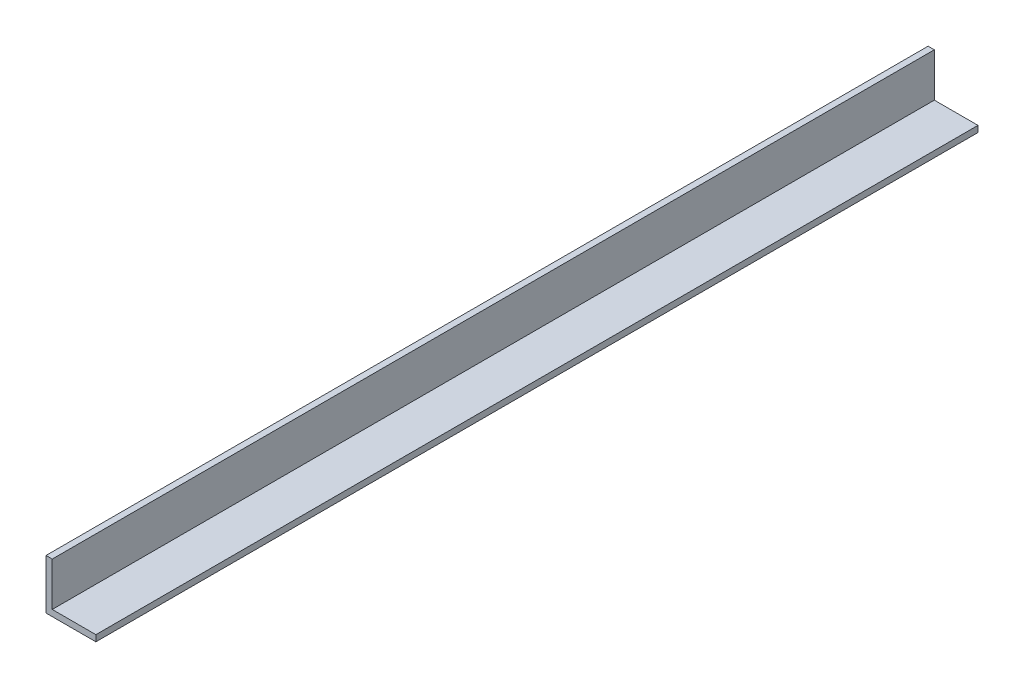
ISO-10303-21;
HEADER;
FILE_DESCRIPTION(('STEP AP214'),'2;1');
FILE_NAME('part.step','',(''),(''),'','','');
FILE_SCHEMA(('AUTOMOTIVE_DESIGN { 1 0 10303 214 1 1 1 1 }'));
ENDSEC;
DATA;
#1=APPLICATION_CONTEXT('core data for automotive mechanical design processes');
#2=APPLICATION_PROTOCOL_DEFINITION('international standard','automotive_design',2000,#1);
#3=PRODUCT_CONTEXT('',#1,'mechanical');
#4=PRODUCT('Part','Part','',(#3));
#5=PRODUCT_RELATED_PRODUCT_CATEGORY('part','',(#4));
#6=PRODUCT_DEFINITION_FORMATION('','',#4);
#7=PRODUCT_DEFINITION_CONTEXT('part definition',#1,'design');
#8=PRODUCT_DEFINITION('design','',#6,#7);
#9=PRODUCT_DEFINITION_SHAPE('','',#8);
#10=(LENGTH_UNIT() NAMED_UNIT(*) SI_UNIT(.MILLI.,.METRE.));
#11=(NAMED_UNIT(*) PLANE_ANGLE_UNIT() SI_UNIT($,.RADIAN.));
#12=(NAMED_UNIT(*) SI_UNIT($,.STERADIAN.) SOLID_ANGLE_UNIT());
#13=UNCERTAINTY_MEASURE_WITH_UNIT(LENGTH_MEASURE(1.E-05),#10,'distance_accuracy_value','');
#14=(GEOMETRIC_REPRESENTATION_CONTEXT(3) GLOBAL_UNCERTAINTY_ASSIGNED_CONTEXT((#13)) GLOBAL_UNIT_ASSIGNED_CONTEXT((#10,
#11,#12)) REPRESENTATION_CONTEXT('',''));
#15=CARTESIAN_POINT('',(0.,0.,0.));
#16=DIRECTION('',(0.,0.,1.));
#17=DIRECTION('',(1.,0.,0.));
#18=AXIS2_PLACEMENT_3D('',#15,#16,#17);
#19=CARTESIAN_POINT('',(3.175,25.4,224.6));
#20=DIRECTION('',(0.,-1.,0.));
#21=DIRECTION('',(0.,0.,-1.));
#22=AXIS2_PLACEMENT_3D('',#19,#20,#21);
#23=PLANE('',#22);
#24=DIRECTION('',(-1.,0.,0.));
#25=VECTOR('',#24,1.);
#26=CARTESIAN_POINT('',(3.175,25.4,-224.6));
#27=LINE('',#26,#25);
#28=CARTESIAN_POINT('',(3.175,25.4,-224.6));
#29=VERTEX_POINT('',#28);
#30=CARTESIAN_POINT('',(0.,25.4,-224.6));
#31=VERTEX_POINT('',#30);
#32=EDGE_CURVE('E127',#29,#31,#27,.T.);
#33=ORIENTED_EDGE('',*,*,#32,.T.);
#34=DIRECTION('',(0.,0.,-1.));
#35=VECTOR('',#34,1.);
#36=CARTESIAN_POINT('',(0.,25.4,224.6));
#37=LINE('',#36,#35);
#38=CARTESIAN_POINT('',(0.,25.4,224.6));
#39=VERTEX_POINT('',#38);
#40=EDGE_CURVE('E11',#39,#31,#37,.T.);
#41=ORIENTED_EDGE('',*,*,#40,.F.);
#42=DIRECTION('',(-1.,0.,0.));
#43=VECTOR('',#42,1.);
#44=CARTESIAN_POINT('',(3.175,25.4,224.6));
#45=LINE('',#44,#43);
#46=CARTESIAN_POINT('',(3.175,25.4,224.6));
#47=VERTEX_POINT('',#46);
#48=EDGE_CURVE('E137',#47,#39,#45,.T.);
#49=ORIENTED_EDGE('',*,*,#48,.F.);
#50=DIRECTION('',(0.,0.,-1.));
#51=VECTOR('',#50,1.);
#52=CARTESIAN_POINT('',(3.175,25.4,224.6));
#53=LINE('',#52,#51);
#54=EDGE_CURVE('E123',#47,#29,#53,.T.);
#55=ORIENTED_EDGE('',*,*,#54,.T.);
#56=EDGE_LOOP('',(#33,#41,#49,#55));
#57=FACE_BOUND('',#56,.T.);
#58=ADVANCED_FACE('F43',(#57),#23,.F.);
#59=CARTESIAN_POINT('',(0.,25.4,224.6));
#60=DIRECTION('',(1.,0.,0.));
#61=DIRECTION('',(0.,0.,-1.));
#62=AXIS2_PLACEMENT_3D('',#59,#60,#61);
#63=PLANE('',#62);
#64=DIRECTION('',(0.,-1.,0.));
#65=VECTOR('',#64,1.);
#66=CARTESIAN_POINT('',(0.,25.4,-224.6));
#67=LINE('',#66,#65);
#68=CARTESIAN_POINT('',(0.,0.,-224.6));
#69=VERTEX_POINT('',#68);
#70=EDGE_CURVE('E130',#31,#69,#67,.T.);
#71=ORIENTED_EDGE('',*,*,#70,.T.);
#72=DIRECTION('',(0.,0.,-1.));
#73=VECTOR('',#72,1.);
#74=CARTESIAN_POINT('',(0.,0.,224.6));
#75=LINE('',#74,#73);
#76=CARTESIAN_POINT('',(0.,0.,224.6));
#77=VERTEX_POINT('',#76);
#78=EDGE_CURVE('E51',#77,#69,#75,.T.);
#79=ORIENTED_EDGE('',*,*,#78,.F.);
#80=DIRECTION('',(0.,-1.,0.));
#81=VECTOR('',#80,1.);
#82=CARTESIAN_POINT('',(0.,25.4,224.6));
#83=LINE('',#82,#81);
#84=EDGE_CURVE('E96',#39,#77,#83,.T.);
#85=ORIENTED_EDGE('',*,*,#84,.F.);
#86=ORIENTED_EDGE('',*,*,#40,.T.);
#87=EDGE_LOOP('',(#71,#79,#85,#86));
#88=FACE_BOUND('',#87,.T.);
#89=ADVANCED_FACE('F161',(#88),#63,.F.);
#90=CARTESIAN_POINT('',(0.,0.,224.6));
#91=DIRECTION('',(0.,1.,0.));
#92=DIRECTION('',(0.,0.,1.));
#93=AXIS2_PLACEMENT_3D('',#90,#91,#92);
#94=PLANE('',#93);
#95=DIRECTION('',(1.,0.,0.));
#96=VECTOR('',#95,1.);
#97=CARTESIAN_POINT('',(0.,0.,-224.6));
#98=LINE('',#97,#96);
#99=CARTESIAN_POINT('',(25.4,0.,-224.6));
#100=VERTEX_POINT('',#99);
#101=EDGE_CURVE('E132',#69,#100,#98,.T.);
#102=ORIENTED_EDGE('',*,*,#101,.T.);
#103=DIRECTION('',(0.,0.,-1.));
#104=VECTOR('',#103,1.);
#105=CARTESIAN_POINT('',(25.4,0.,224.6));
#106=LINE('',#105,#104);
#107=CARTESIAN_POINT('',(25.4,0.,224.6));
#108=VERTEX_POINT('',#107);
#109=EDGE_CURVE('E118',#108,#100,#106,.T.);
#110=ORIENTED_EDGE('',*,*,#109,.F.);
#111=DIRECTION('',(1.,0.,0.));
#112=VECTOR('',#111,1.);
#113=CARTESIAN_POINT('',(0.,0.,224.6));
#114=LINE('',#113,#112);
#115=EDGE_CURVE('E109',#77,#108,#114,.T.);
#116=ORIENTED_EDGE('',*,*,#115,.F.);
#117=ORIENTED_EDGE('',*,*,#78,.T.);
#118=EDGE_LOOP('',(#102,#110,#116,#117));
#119=FACE_BOUND('',#118,.T.);
#120=ADVANCED_FACE('F143',(#119),#94,.F.);
#121=CARTESIAN_POINT('',(25.4,0.,224.6));
#122=DIRECTION('',(-1.,0.,0.));
#123=DIRECTION('',(0.,0.,1.));
#124=AXIS2_PLACEMENT_3D('',#121,#122,#123);
#125=PLANE('',#124);
#126=DIRECTION('',(0.,1.,0.));
#127=VECTOR('',#126,1.);
#128=CARTESIAN_POINT('',(25.4,0.,-224.6));
#129=LINE('',#128,#127);
#130=CARTESIAN_POINT('',(25.4,3.175,-224.6));
#131=VERTEX_POINT('',#130);
#132=EDGE_CURVE('E117',#100,#131,#129,.T.);
#133=ORIENTED_EDGE('',*,*,#132,.T.);
#134=DIRECTION('',(0.,0.,-1.));
#135=VECTOR('',#134,1.);
#136=CARTESIAN_POINT('',(25.4,3.175,224.6));
#137=LINE('',#136,#135);
#138=CARTESIAN_POINT('',(25.4,3.175,224.6));
#139=VERTEX_POINT('',#138);
#140=EDGE_CURVE('E114',#139,#131,#137,.T.);
#141=ORIENTED_EDGE('',*,*,#140,.F.);
#142=DIRECTION('',(0.,1.,0.));
#143=VECTOR('',#142,1.);
#144=CARTESIAN_POINT('',(25.4,0.,224.6));
#145=LINE('',#144,#143);
#146=EDGE_CURVE('E103',#108,#139,#145,.T.);
#147=ORIENTED_EDGE('',*,*,#146,.F.);
#148=ORIENTED_EDGE('',*,*,#109,.T.);
#149=EDGE_LOOP('',(#133,#141,#147,#148));
#150=FACE_BOUND('',#149,.T.);
#151=ADVANCED_FACE('F115',(#150),#125,.F.);
#152=CARTESIAN_POINT('',(25.4,3.175,224.6));
#153=DIRECTION('',(0.,-1.,0.));
#154=DIRECTION('',(0.,0.,-1.));
#155=AXIS2_PLACEMENT_3D('',#152,#153,#154);
#156=PLANE('',#155);
#157=DIRECTION('',(-1.,0.,0.));
#158=VECTOR('',#157,1.);
#159=CARTESIAN_POINT('',(25.4,3.175,-224.6));
#160=LINE('',#159,#158);
#161=CARTESIAN_POINT('',(3.175,3.175,-224.6));
#162=VERTEX_POINT('',#161);
#163=EDGE_CURVE('E82',#131,#162,#160,.T.);
#164=ORIENTED_EDGE('',*,*,#163,.T.);
#165=DIRECTION('',(0.,0.,-1.));
#166=VECTOR('',#165,1.);
#167=CARTESIAN_POINT('',(3.175,3.175,224.6));
#168=LINE('',#167,#166);
#169=CARTESIAN_POINT('',(3.175,3.175,224.6));
#170=VERTEX_POINT('',#169);
#171=EDGE_CURVE('E119',#170,#162,#168,.T.);
#172=ORIENTED_EDGE('',*,*,#171,.F.);
#173=DIRECTION('',(-1.,0.,0.));
#174=VECTOR('',#173,1.);
#175=CARTESIAN_POINT('',(25.4,3.175,224.6));
#176=LINE('',#175,#174);
#177=EDGE_CURVE('E107',#139,#170,#176,.T.);
#178=ORIENTED_EDGE('',*,*,#177,.F.);
#179=ORIENTED_EDGE('',*,*,#140,.T.);
#180=EDGE_LOOP('',(#164,#172,#178,#179));
#181=FACE_BOUND('',#180,.T.);
#182=ADVANCED_FACE('F121',(#181),#156,.F.);
#183=CARTESIAN_POINT('',(3.175,3.175,224.6));
#184=DIRECTION('',(-1.,0.,0.));
#185=DIRECTION('',(0.,0.,1.));
#186=AXIS2_PLACEMENT_3D('',#183,#184,#185);
#187=PLANE('',#186);
#188=DIRECTION('',(0.,1.,0.));
#189=VECTOR('',#188,1.);
#190=CARTESIAN_POINT('',(3.175,3.175,-224.6));
#191=LINE('',#190,#189);
#192=EDGE_CURVE('E88',#162,#29,#191,.T.);
#193=ORIENTED_EDGE('',*,*,#192,.T.);
#194=ORIENTED_EDGE('',*,*,#54,.F.);
#195=DIRECTION('',(0.,1.,0.));
#196=VECTOR('',#195,1.);
#197=CARTESIAN_POINT('',(3.175,3.175,224.6));
#198=LINE('',#197,#196);
#199=EDGE_CURVE('E59',#170,#47,#198,.T.);
#200=ORIENTED_EDGE('',*,*,#199,.F.);
#201=ORIENTED_EDGE('',*,*,#171,.T.);
#202=EDGE_LOOP('',(#193,#194,#200,#201));
#203=FACE_BOUND('',#202,.T.);
#204=ADVANCED_FACE('F150',(#203),#187,.F.);
#205=CARTESIAN_POINT('',(0.,0.,224.6));
#206=DIRECTION('',(0.,0.,1.));
#207=DIRECTION('',(1.,0.,0.));
#208=AXIS2_PLACEMENT_3D('',#205,#206,#207);
#209=PLANE('',#208);
#210=ORIENTED_EDGE('',*,*,#48,.T.);
#211=ORIENTED_EDGE('',*,*,#84,.T.);
#212=ORIENTED_EDGE('',*,*,#115,.T.);
#213=ORIENTED_EDGE('',*,*,#146,.T.);
#214=ORIENTED_EDGE('',*,*,#177,.T.);
#215=ORIENTED_EDGE('',*,*,#199,.T.);
#216=EDGE_LOOP('',(#210,#211,#212,#213,#214,#215));
#217=FACE_BOUND('',#216,.T.);
#218=ADVANCED_FACE('F105',(#217),#209,.T.);
#219=CARTESIAN_POINT('',(0.,0.,-224.6));
#220=DIRECTION('',(0.,0.,1.));
#221=DIRECTION('',(1.,0.,0.));
#222=AXIS2_PLACEMENT_3D('',#219,#220,#221);
#223=PLANE('',#222);
#224=ORIENTED_EDGE('',*,*,#32,.F.);
#225=ORIENTED_EDGE('',*,*,#192,.F.);
#226=ORIENTED_EDGE('',*,*,#163,.F.);
#227=ORIENTED_EDGE('',*,*,#132,.F.);
#228=ORIENTED_EDGE('',*,*,#101,.F.);
#229=ORIENTED_EDGE('',*,*,#70,.F.);
#230=EDGE_LOOP('',(#224,#225,#226,#227,#228,#229));
#231=FACE_BOUND('',#230,.T.);
#232=ADVANCED_FACE('F146',(#231),#223,.F.);
#233=CLOSED_SHELL('',(#58,#89,#120,#151,#182,#204,#218,#232));
#234=MANIFOLD_SOLID_BREP('B2',#233);
#235=ADVANCED_BREP_SHAPE_REPRESENTATION('',(#18,#234),#14);
#236=SHAPE_DEFINITION_REPRESENTATION(#9,#235);
ENDSEC;
END-ISO-10303-21;
